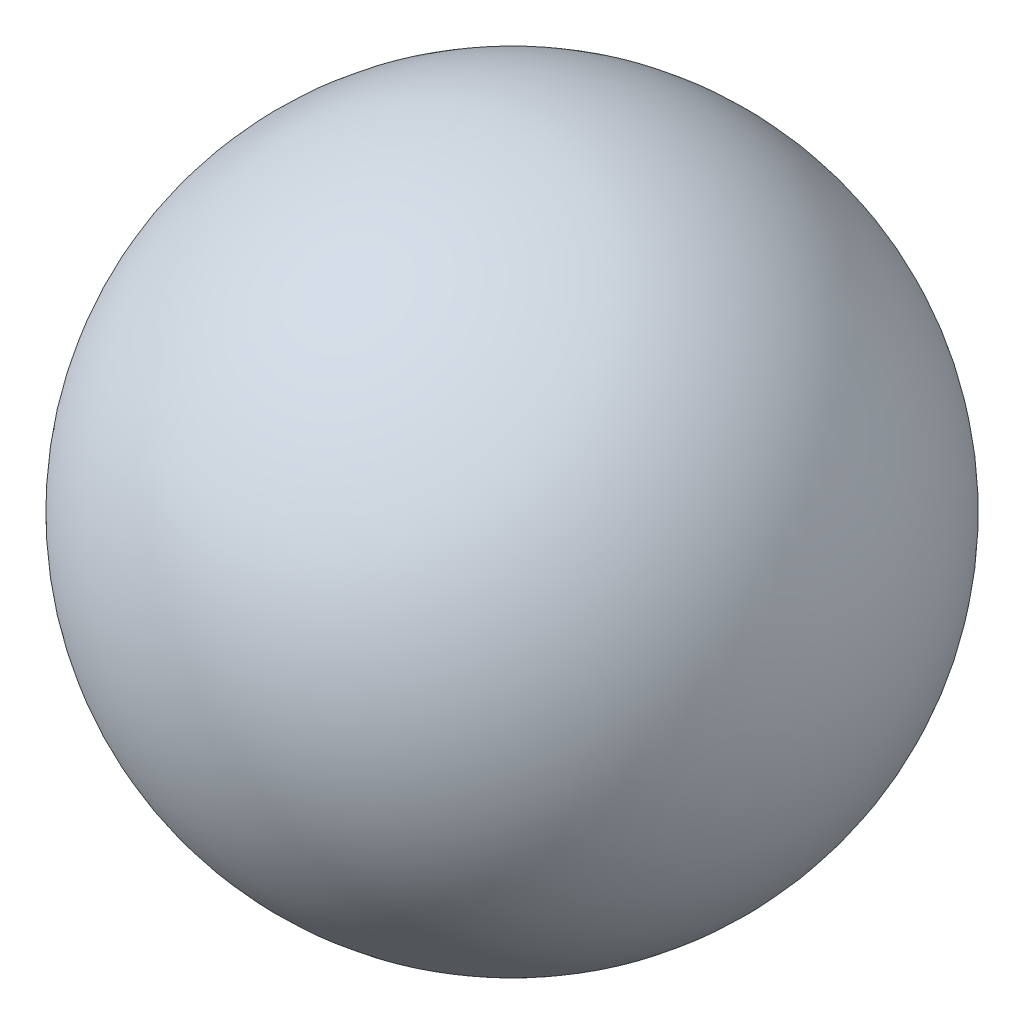
ISO-10303-21;
HEADER;
FILE_DESCRIPTION(('STEP AP214'),'2;1');
FILE_NAME('part.step','',(''),(''),'','','');
FILE_SCHEMA(('AUTOMOTIVE_DESIGN { 1 0 10303 214 1 1 1 1 }'));
ENDSEC;
DATA;
#1=APPLICATION_CONTEXT('core data for automotive mechanical design processes');
#2=APPLICATION_PROTOCOL_DEFINITION('international standard','automotive_design',2000,#1);
#3=PRODUCT_CONTEXT('',#1,'mechanical');
#4=PRODUCT('Part','Part','',(#3));
#5=PRODUCT_RELATED_PRODUCT_CATEGORY('part','',(#4));
#6=PRODUCT_DEFINITION_FORMATION('','',#4);
#7=PRODUCT_DEFINITION_CONTEXT('part definition',#1,'design');
#8=PRODUCT_DEFINITION('design','',#6,#7);
#9=PRODUCT_DEFINITION_SHAPE('','',#8);
#10=(LENGTH_UNIT() NAMED_UNIT(*) SI_UNIT(.MILLI.,.METRE.));
#11=(NAMED_UNIT(*) PLANE_ANGLE_UNIT() SI_UNIT($,.RADIAN.));
#12=(NAMED_UNIT(*) SI_UNIT($,.STERADIAN.) SOLID_ANGLE_UNIT());
#13=UNCERTAINTY_MEASURE_WITH_UNIT(LENGTH_MEASURE(1.E-05),#10,'distance_accuracy_value','');
#14=(GEOMETRIC_REPRESENTATION_CONTEXT(3) GLOBAL_UNCERTAINTY_ASSIGNED_CONTEXT((#13)) GLOBAL_UNIT_ASSIGNED_CONTEXT((#10,
#11,#12)) REPRESENTATION_CONTEXT('',''));
#15=CARTESIAN_POINT('',(0.,0.,0.));
#16=DIRECTION('',(0.,0.,1.));
#17=DIRECTION('',(1.,0.,0.));
#18=AXIS2_PLACEMENT_3D('',#15,#16,#17);
#19=CARTESIAN_POINT('',(0.,0.,0.));
#20=DIRECTION('',(0.,1.,0.));
#21=DIRECTION('',(1.,0.,0.));
#22=AXIS2_PLACEMENT_3D('',#19,#20,#21);
#23=SPHERICAL_SURFACE('',#22,21.336);
#24=CARTESIAN_POINT('',(0.,21.336,0.));
#25=VERTEX_POINT('',#24);
#26=VERTEX_LOOP('',#25);
#27=FACE_BOUND('',#26,.T.);
#28=ADVANCED_FACE('F37',(#27),#23,.T.);
#29=CLOSED_SHELL('',(#28));
#30=MANIFOLD_SOLID_BREP('B2',#29);
#31=ADVANCED_BREP_SHAPE_REPRESENTATION('',(#18,#30),#14);
#32=SHAPE_DEFINITION_REPRESENTATION(#9,#31);
ENDSEC;
END-ISO-10303-21;
